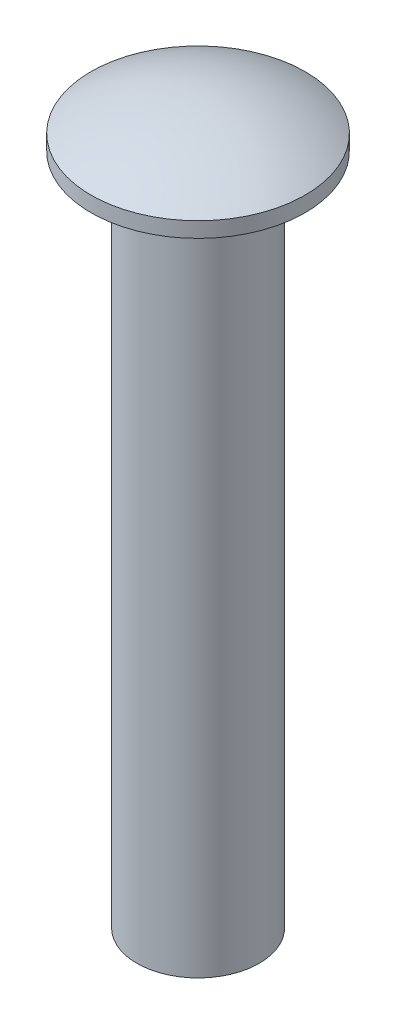
ISO-10303-21;
HEADER;
FILE_DESCRIPTION(('STEP AP214'),'2;1');
FILE_NAME('part.step','',(''),(''),'','','');
FILE_SCHEMA(('AUTOMOTIVE_DESIGN { 1 0 10303 214 1 1 1 1 }'));
ENDSEC;
DATA;
#1=APPLICATION_CONTEXT('core data for automotive mechanical design processes');
#2=APPLICATION_PROTOCOL_DEFINITION('international standard','automotive_design',2000,#1);
#3=PRODUCT_CONTEXT('',#1,'mechanical');
#4=PRODUCT('Part','Part','',(#3));
#5=PRODUCT_RELATED_PRODUCT_CATEGORY('part','',(#4));
#6=PRODUCT_DEFINITION_FORMATION('','',#4);
#7=PRODUCT_DEFINITION_CONTEXT('part definition',#1,'design');
#8=PRODUCT_DEFINITION('design','',#6,#7);
#9=PRODUCT_DEFINITION_SHAPE('','',#8);
#10=(LENGTH_UNIT() NAMED_UNIT(*) SI_UNIT(.MILLI.,.METRE.));
#11=(NAMED_UNIT(*) PLANE_ANGLE_UNIT() SI_UNIT($,.RADIAN.));
#12=(NAMED_UNIT(*) SI_UNIT($,.STERADIAN.) SOLID_ANGLE_UNIT());
#13=UNCERTAINTY_MEASURE_WITH_UNIT(LENGTH_MEASURE(1.E-05),#10,'distance_accuracy_value','');
#14=(GEOMETRIC_REPRESENTATION_CONTEXT(3) GLOBAL_UNCERTAINTY_ASSIGNED_CONTEXT((#13)) GLOBAL_UNIT_ASSIGNED_CONTEXT((#10,
#11,#12)) REPRESENTATION_CONTEXT('',''));
#15=CARTESIAN_POINT('',(0.,0.,0.));
#16=DIRECTION('',(0.,0.,1.));
#17=DIRECTION('',(1.,0.,0.));
#18=AXIS2_PLACEMENT_3D('',#15,#16,#17);
#19=CARTESIAN_POINT('',(0.,16.875,0.));
#20=DIRECTION('',(-1.,0.,0.));
#21=DIRECTION('',(0.,0.844052338983823,0.53626080320674));
#22=AXIS2_PLACEMENT_3D('',#19,#20,#21);
#23=SPHERICAL_SURFACE('',#22,6.625);
#24=CARTESIAN_POINT('',(0.,16.875,0.));
#25=DIRECTION('',(0.,-1.,0.));
#26=DIRECTION('',(0.,0.,-1.));
#27=AXIS2_PLACEMENT_3D('',#24,#25,#26);
#28=SPHERICAL_SURFACE('',#27,6.625);
#29=CARTESIAN_POINT('',(0.,22.5,0.));
#30=DIRECTION('',(0.,-1.,0.));
#31=DIRECTION('',(0.,0.,-1.));
#32=AXIS2_PLACEMENT_3D('',#29,#30,#31);
#33=CIRCLE('',#32,3.5);
#34=CARTESIAN_POINT('',(0.,22.5,-3.5));
#35=VERTEX_POINT('',#34);
#36=EDGE_CURVE('E19',#35,#35,#33,.T.);
#37=ORIENTED_EDGE('',*,*,#36,.F.);
#38=EDGE_LOOP('',(#37));
#39=FACE_BOUND('',#38,.T.);
#40=ADVANCED_FACE('F15',(#39),#28,.T.);
#41=CARTESIAN_POINT('',(0.,24.675,0.));
#42=DIRECTION('',(0.,-1.,0.));
#43=DIRECTION('',(0.,0.,-1.));
#44=AXIS2_PLACEMENT_3D('',#41,#42,#43);
#45=CYLINDRICAL_SURFACE('',#44,3.5);
#46=ORIENTED_EDGE('',*,*,#36,.T.);
#47=EDGE_LOOP('',(#46));
#48=FACE_BOUND('',#47,.T.);
#49=CARTESIAN_POINT('',(0.,22.,0.));
#50=DIRECTION('',(0.,-1.,0.));
#51=DIRECTION('',(0.,0.,-1.));
#52=AXIS2_PLACEMENT_3D('',#49,#50,#51);
#53=CIRCLE('',#52,3.5);
#54=CARTESIAN_POINT('',(0.,22.,-3.5));
#55=VERTEX_POINT('',#54);
#56=EDGE_CURVE('E32',#55,#55,#53,.T.);
#57=ORIENTED_EDGE('',*,*,#56,.F.);
#58=EDGE_LOOP('',(#57));
#59=FACE_BOUND('',#58,.T.);
#60=ADVANCED_FACE('F39',(#48,#59),#45,.T.);
#61=CARTESIAN_POINT('',(0.,0.,0.));
#62=DIRECTION('',(-1.,0.,0.));
#63=DIRECTION('',(0.,0.,-1.));
#64=AXIS2_PLACEMENT_3D('',#61,#62,#63);
#65=SPHERICAL_SURFACE('',#64,1.7);
#66=CARTESIAN_POINT('',(0.,0.,0.));
#67=DIRECTION('',(0.,-1.,5.85952827642253E-13));
#68=DIRECTION('',(0.,-5.85952827642253E-13,-1.));
#69=AXIS2_PLACEMENT_3D('',#66,#67,#68);
#70=SPHERICAL_SURFACE('',#69,1.7);
#71=CARTESIAN_POINT('',(0.,0.,0.));
#72=DIRECTION('',(0.,-1.,5.85952827642253E-13));
#73=DIRECTION('',(0.,-5.85952827642253E-13,-1.));
#74=AXIS2_PLACEMENT_3D('',#71,#72,#73);
#75=CIRCLE('',#74,1.7);
#76=CARTESIAN_POINT('',(0.,-9.9611980699183E-13,-1.7));
#77=VERTEX_POINT('',#76);
#78=EDGE_CURVE('E28',#77,#77,#75,.F.);
#79=ORIENTED_EDGE('',*,*,#78,.F.);
#80=EDGE_LOOP('',(#79));
#81=FACE_BOUND('',#80,.T.);
#82=ADVANCED_FACE('F17',(#81),#70,.F.);
#83=CARTESIAN_POINT('',(0.,22.,0.));
#84=DIRECTION('',(0.,-1.,0.));
#85=DIRECTION('',(0.,0.,-1.));
#86=AXIS2_PLACEMENT_3D('',#83,#84,#85);
#87=PLANE('',#86);
#88=ORIENTED_EDGE('',*,*,#56,.T.);
#89=EDGE_LOOP('',(#88));
#90=FACE_BOUND('',#89,.T.);
#91=CARTESIAN_POINT('',(0.,22.,0.));
#92=DIRECTION('',(0.,-1.,0.));
#93=DIRECTION('',(0.,0.,-1.));
#94=AXIS2_PLACEMENT_3D('',#91,#92,#93);
#95=CIRCLE('',#94,2.);
#96=CARTESIAN_POINT('',(0.,22.,-2.));
#97=VERTEX_POINT('',#96);
#98=EDGE_CURVE('E23',#97,#97,#95,.T.);
#99=ORIENTED_EDGE('',*,*,#98,.F.);
#100=EDGE_LOOP('',(#99));
#101=FACE_BOUND('',#100,.T.);
#102=ADVANCED_FACE('F55',(#90,#101),#87,.T.);
#103=CARTESIAN_POINT('',(0.,0.,0.));
#104=DIRECTION('',(0.,-1.,0.));
#105=DIRECTION('',(0.,0.,-1.));
#106=AXIS2_PLACEMENT_3D('',#103,#104,#105);
#107=PLANE('',#106);
#108=CARTESIAN_POINT('',(0.,0.,0.));
#109=DIRECTION('',(0.,-1.,0.));
#110=DIRECTION('',(0.,0.,-1.));
#111=AXIS2_PLACEMENT_3D('',#108,#109,#110);
#112=CIRCLE('',#111,2.);
#113=CARTESIAN_POINT('',(0.,0.,-2.));
#114=VERTEX_POINT('',#113);
#115=EDGE_CURVE('E10',#114,#114,#112,.F.);
#116=ORIENTED_EDGE('',*,*,#115,.F.);
#117=EDGE_LOOP('',(#116));
#118=FACE_BOUND('',#117,.T.);
#119=ORIENTED_EDGE('',*,*,#78,.T.);
#120=EDGE_LOOP('',(#119));
#121=FACE_BOUND('',#120,.T.);
#122=ADVANCED_FACE('F50',(#118,#121),#107,.T.);
#123=CARTESIAN_POINT('',(0.,24.675,0.));
#124=DIRECTION('',(0.,-1.,0.));
#125=DIRECTION('',(0.,0.,-1.));
#126=AXIS2_PLACEMENT_3D('',#123,#124,#125);
#127=CYLINDRICAL_SURFACE('',#126,2.);
#128=ORIENTED_EDGE('',*,*,#115,.T.);
#129=EDGE_LOOP('',(#128));
#130=FACE_BOUND('',#129,.T.);
#131=ORIENTED_EDGE('',*,*,#98,.T.);
#132=EDGE_LOOP('',(#131));
#133=FACE_BOUND('',#132,.T.);
#134=ADVANCED_FACE('F48',(#130,#133),#127,.T.);
#135=CLOSED_SHELL('',(#40,#60,#82,#102,#122,#134));
#136=MANIFOLD_SOLID_BREP('B1',#135);
#137=ADVANCED_BREP_SHAPE_REPRESENTATION('',(#18,#136),#14);
#138=SHAPE_DEFINITION_REPRESENTATION(#9,#137);
ENDSEC;
END-ISO-10303-21;
